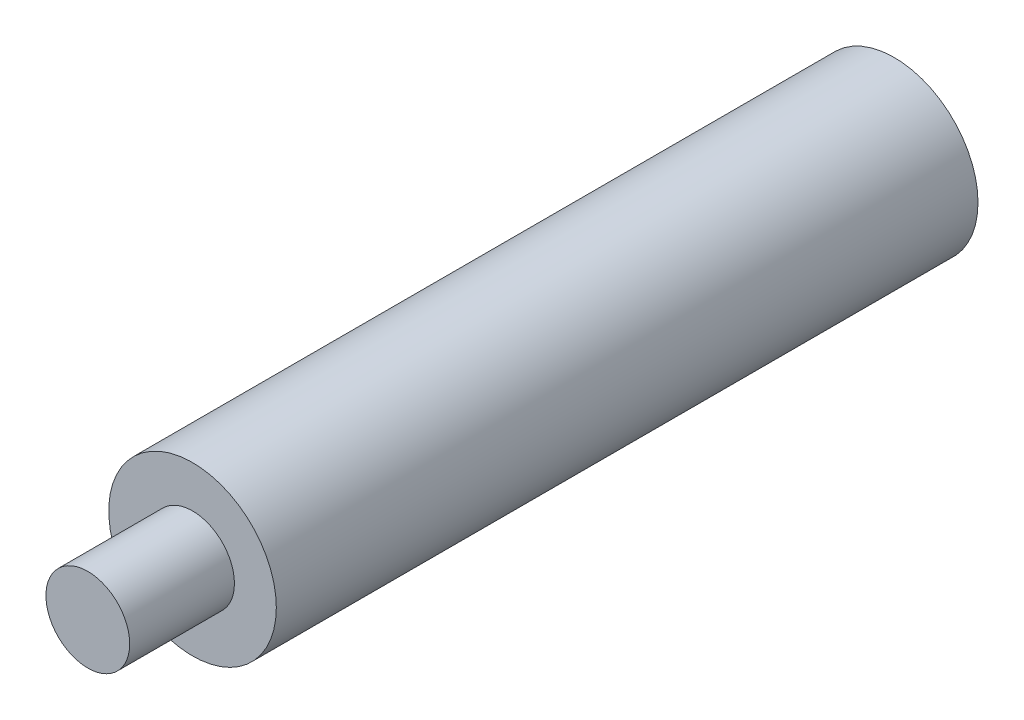
ISO-10303-21;
HEADER;
FILE_DESCRIPTION(('STEP AP214'),'2;1');
FILE_NAME('part.step','',(''),(''),'','','');
FILE_SCHEMA(('AUTOMOTIVE_DESIGN { 1 0 10303 214 1 1 1 1 }'));
ENDSEC;
DATA;
#1=APPLICATION_CONTEXT('core data for automotive mechanical design processes');
#2=APPLICATION_PROTOCOL_DEFINITION('international standard','automotive_design',2000,#1);
#3=PRODUCT_CONTEXT('',#1,'mechanical');
#4=PRODUCT('Part','Part','',(#3));
#5=PRODUCT_RELATED_PRODUCT_CATEGORY('part','',(#4));
#6=PRODUCT_DEFINITION_FORMATION('','',#4);
#7=PRODUCT_DEFINITION_CONTEXT('part definition',#1,'design');
#8=PRODUCT_DEFINITION('design','',#6,#7);
#9=PRODUCT_DEFINITION_SHAPE('','',#8);
#10=(LENGTH_UNIT() NAMED_UNIT(*) SI_UNIT(.MILLI.,.METRE.));
#11=(NAMED_UNIT(*) PLANE_ANGLE_UNIT() SI_UNIT($,.RADIAN.));
#12=(NAMED_UNIT(*) SI_UNIT($,.STERADIAN.) SOLID_ANGLE_UNIT());
#13=UNCERTAINTY_MEASURE_WITH_UNIT(LENGTH_MEASURE(1.E-05),#10,'distance_accuracy_value','');
#14=(GEOMETRIC_REPRESENTATION_CONTEXT(3) GLOBAL_UNCERTAINTY_ASSIGNED_CONTEXT((#13)) GLOBAL_UNIT_ASSIGNED_CONTEXT((#10,
#11,#12)) REPRESENTATION_CONTEXT('',''));
#15=CARTESIAN_POINT('',(0.,0.,0.));
#16=DIRECTION('',(0.,0.,1.));
#17=DIRECTION('',(1.,0.,0.));
#18=AXIS2_PLACEMENT_3D('',#15,#16,#17);
#19=CARTESIAN_POINT('',(0.,0.,33.5));
#20=DIRECTION('',(0.,0.,-1.));
#21=DIRECTION('',(-1.,0.,0.));
#22=AXIS2_PLACEMENT_3D('',#19,#20,#21);
#23=CYLINDRICAL_SURFACE('',#22,4.);
#24=CARTESIAN_POINT('',(0.,0.,33.5));
#25=DIRECTION('',(0.,0.,1.));
#26=DIRECTION('',(1.,0.,0.));
#27=AXIS2_PLACEMENT_3D('',#24,#25,#26);
#28=CIRCLE('',#27,4.);
#29=CARTESIAN_POINT('',(4.,0.,33.5));
#30=VERTEX_POINT('',#29);
#31=EDGE_CURVE('E46',#30,#30,#28,.T.);
#32=ORIENTED_EDGE('',*,*,#31,.F.);
#33=EDGE_LOOP('',(#32));
#34=FACE_BOUND('',#33,.T.);
#35=CARTESIAN_POINT('',(0.,0.,0.));
#36=DIRECTION('',(0.,0.,1.));
#37=DIRECTION('',(1.,0.,0.));
#38=AXIS2_PLACEMENT_3D('',#35,#36,#37);
#39=CIRCLE('',#38,4.);
#40=CARTESIAN_POINT('',(4.,0.,0.));
#41=VERTEX_POINT('',#40);
#42=EDGE_CURVE('E42',#41,#41,#39,.T.);
#43=ORIENTED_EDGE('',*,*,#42,.T.);
#44=EDGE_LOOP('',(#43));
#45=FACE_BOUND('',#44,.T.);
#46=ADVANCED_FACE('F39',(#34,#45),#23,.T.);
#47=CARTESIAN_POINT('',(0.,0.,33.5));
#48=DIRECTION('',(0.,0.,1.));
#49=DIRECTION('',(1.,0.,0.));
#50=AXIS2_PLACEMENT_3D('',#47,#48,#49);
#51=PLANE('',#50);
#52=CARTESIAN_POINT('',(0.,0.,33.5));
#53=DIRECTION('',(0.,0.,1.));
#54=DIRECTION('',(1.,0.,0.));
#55=AXIS2_PLACEMENT_3D('',#52,#53,#54);
#56=CIRCLE('',#55,2.);
#57=CARTESIAN_POINT('',(2.,0.,33.5));
#58=VERTEX_POINT('',#57);
#59=EDGE_CURVE('E10',#58,#58,#56,.T.);
#60=ORIENTED_EDGE('',*,*,#59,.F.);
#61=EDGE_LOOP('',(#60));
#62=FACE_BOUND('',#61,.T.);
#63=ORIENTED_EDGE('',*,*,#31,.T.);
#64=EDGE_LOOP('',(#63));
#65=FACE_BOUND('',#64,.T.);
#66=ADVANCED_FACE('F75',(#62,#65),#51,.T.);
#67=CARTESIAN_POINT('',(0.,0.,0.));
#68=DIRECTION('',(0.,0.,1.));
#69=DIRECTION('',(1.,0.,0.));
#70=AXIS2_PLACEMENT_3D('',#67,#68,#69);
#71=PLANE('',#70);
#72=CARTESIAN_POINT('',(0.,0.,0.));
#73=DIRECTION('',(0.,0.,-1.));
#74=DIRECTION('',(-1.,0.,0.));
#75=AXIS2_PLACEMENT_3D('',#72,#73,#74);
#76=CIRCLE('',#75,1.5);
#77=CARTESIAN_POINT('',(-1.5,0.,0.));
#78=VERTEX_POINT('',#77);
#79=EDGE_CURVE('E56',#78,#78,#76,.T.);
#80=ORIENTED_EDGE('',*,*,#79,.F.);
#81=EDGE_LOOP('',(#80));
#82=FACE_BOUND('',#81,.T.);
#83=ORIENTED_EDGE('',*,*,#42,.F.);
#84=EDGE_LOOP('',(#83));
#85=FACE_BOUND('',#84,.T.);
#86=ADVANCED_FACE('F71',(#82,#85),#71,.F.);
#87=CARTESIAN_POINT('',(0.,0.,38.5));
#88=DIRECTION('',(0.,0.,-1.));
#89=DIRECTION('',(-1.,0.,0.));
#90=AXIS2_PLACEMENT_3D('',#87,#88,#89);
#91=CYLINDRICAL_SURFACE('',#90,2.);
#92=CARTESIAN_POINT('',(0.,0.,38.5));
#93=DIRECTION('',(0.,0.,1.));
#94=DIRECTION('',(1.,0.,0.));
#95=AXIS2_PLACEMENT_3D('',#92,#93,#94);
#96=CIRCLE('',#95,2.);
#97=CARTESIAN_POINT('',(2.,0.,38.5));
#98=VERTEX_POINT('',#97);
#99=EDGE_CURVE('E52',#98,#98,#96,.T.);
#100=ORIENTED_EDGE('',*,*,#99,.F.);
#101=EDGE_LOOP('',(#100));
#102=FACE_BOUND('',#101,.T.);
#103=ORIENTED_EDGE('',*,*,#59,.T.);
#104=EDGE_LOOP('',(#103));
#105=FACE_BOUND('',#104,.T.);
#106=ADVANCED_FACE('F74',(#102,#105),#91,.T.);
#107=CARTESIAN_POINT('',(0.,0.,38.5));
#108=DIRECTION('',(0.,0.,1.));
#109=DIRECTION('',(1.,0.,0.));
#110=AXIS2_PLACEMENT_3D('',#107,#108,#109);
#111=PLANE('',#110);
#112=ORIENTED_EDGE('',*,*,#99,.T.);
#113=EDGE_LOOP('',(#112));
#114=FACE_BOUND('',#113,.T.);
#115=ADVANCED_FACE('F67',(#114),#111,.T.);
#116=CARTESIAN_POINT('',(0.,0.,10.));
#117=DIRECTION('',(0.,0.,-1.));
#118=DIRECTION('',(-1.,0.,0.));
#119=AXIS2_PLACEMENT_3D('',#116,#117,#118);
#120=CYLINDRICAL_SURFACE('',#119,1.5);
#121=CARTESIAN_POINT('',(0.,0.,10.));
#122=DIRECTION('',(0.,0.,-1.));
#123=DIRECTION('',(-1.,0.,0.));
#124=AXIS2_PLACEMENT_3D('',#121,#122,#123);
#125=CIRCLE('',#124,1.5);
#126=CARTESIAN_POINT('',(-1.5,0.,10.));
#127=VERTEX_POINT('',#126);
#128=EDGE_CURVE('E55',#127,#127,#125,.T.);
#129=ORIENTED_EDGE('',*,*,#128,.F.);
#130=EDGE_LOOP('',(#129));
#131=FACE_BOUND('',#130,.T.);
#132=ORIENTED_EDGE('',*,*,#79,.T.);
#133=EDGE_LOOP('',(#132));
#134=FACE_BOUND('',#133,.T.);
#135=ADVANCED_FACE('F64',(#131,#134),#120,.F.);
#136=CARTESIAN_POINT('',(0.,0.,10.));
#137=DIRECTION('',(0.,0.,-1.));
#138=DIRECTION('',(-1.,0.,0.));
#139=AXIS2_PLACEMENT_3D('',#136,#137,#138);
#140=PLANE('',#139);
#141=ORIENTED_EDGE('',*,*,#128,.T.);
#142=EDGE_LOOP('',(#141));
#143=FACE_BOUND('',#142,.T.);
#144=ADVANCED_FACE('F62',(#143),#140,.T.);
#145=CLOSED_SHELL('',(#46,#66,#86,#106,#115,#135,#144));
#146=MANIFOLD_SOLID_BREP('B2',#145);
#147=ADVANCED_BREP_SHAPE_REPRESENTATION('',(#18,#146),#14);
#148=SHAPE_DEFINITION_REPRESENTATION(#9,#147);
ENDSEC;
END-ISO-10303-21;
